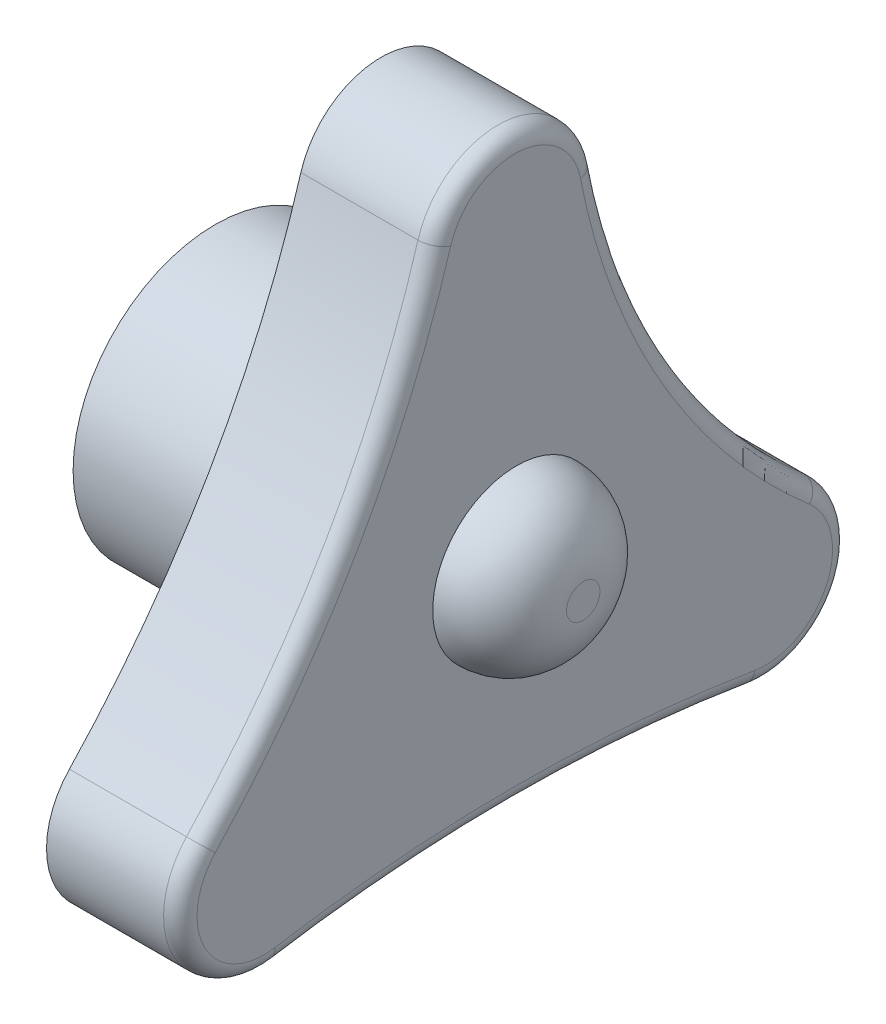
ISO-10303-21;
HEADER;
FILE_DESCRIPTION(('STEP AP214'),'2;1');
FILE_NAME('part.step','',(''),(''),'','','');
FILE_SCHEMA(('AUTOMOTIVE_DESIGN { 1 0 10303 214 1 1 1 1 }'));
ENDSEC;
DATA;
#1=APPLICATION_CONTEXT('core data for automotive mechanical design processes');
#2=APPLICATION_PROTOCOL_DEFINITION('international standard','automotive_design',2000,#1);
#3=PRODUCT_CONTEXT('',#1,'mechanical');
#4=PRODUCT('Part','Part','',(#3));
#5=PRODUCT_RELATED_PRODUCT_CATEGORY('part','',(#4));
#6=PRODUCT_DEFINITION_FORMATION('','',#4);
#7=PRODUCT_DEFINITION_CONTEXT('part definition',#1,'design');
#8=PRODUCT_DEFINITION('design','',#6,#7);
#9=PRODUCT_DEFINITION_SHAPE('','',#8);
#10=(LENGTH_UNIT() NAMED_UNIT(*) SI_UNIT(.MILLI.,.METRE.));
#11=(NAMED_UNIT(*) PLANE_ANGLE_UNIT() SI_UNIT($,.RADIAN.));
#12=(NAMED_UNIT(*) SI_UNIT($,.STERADIAN.) SOLID_ANGLE_UNIT());
#13=UNCERTAINTY_MEASURE_WITH_UNIT(LENGTH_MEASURE(1.E-05),#10,'distance_accuracy_value','');
#14=(GEOMETRIC_REPRESENTATION_CONTEXT(3) GLOBAL_UNCERTAINTY_ASSIGNED_CONTEXT((#13)) GLOBAL_UNIT_ASSIGNED_CONTEXT((#10,
#11,#12)) REPRESENTATION_CONTEXT('',''));
#15=CARTESIAN_POINT('',(0.,0.,0.));
#16=DIRECTION('',(0.,0.,1.));
#17=DIRECTION('',(1.,0.,0.));
#18=AXIS2_PLACEMENT_3D('',#15,#16,#17);
#19=CARTESIAN_POINT('',(4.,22.2408184057305,31.0222274806383));
#20=DIRECTION('',(-1.,0.,0.));
#21=DIRECTION('',(0.,0.,1.));
#22=AXIS2_PLACEMENT_3D('',#19,#20,#21);
#23=CYLINDRICAL_SURFACE('',#22,29.872043324566);
#24=DIRECTION('',(-1.,0.,0.));
#25=VECTOR('',#24,1.);
#26=CARTESIAN_POINT('',(4.,1.71759457556799,9.31655412085064));
#27=LINE('',#26,#25);
#28=CARTESIAN_POINT('',(3.5,1.71759457556799,9.31655412085064));
#29=VERTEX_POINT('',#28);
#30=CARTESIAN_POINT('',(0.,1.71759457556799,9.31655412085064));
#31=VERTEX_POINT('',#30);
#32=EDGE_CURVE('E231',#29,#31,#27,.T.);
#33=ORIENTED_EDGE('',*,*,#32,.F.);
#34=CARTESIAN_POINT('',(3.5,22.2408184057305,31.0222274806383));
#35=DIRECTION('',(1.,0.,0.));
#36=DIRECTION('',(0.,0.,-1.));
#37=AXIS2_PLACEMENT_3D('',#34,#35,#36);
#38=CIRCLE('',#37,29.872043324566);
#39=CARTESIAN_POINT('',(3.5,13.7047657849885,2.39575759626954));
#40=VERTEX_POINT('',#39);
#41=EDGE_CURVE('E256',#29,#40,#38,.T.);
#42=ORIENTED_EDGE('',*,*,#41,.T.);
#43=DIRECTION('',(-1.,0.,0.));
#44=VECTOR('',#43,1.);
#45=CARTESIAN_POINT('',(4.,13.7047657849885,2.39575759626954));
#46=LINE('',#45,#44);
#47=CARTESIAN_POINT('',(0.,13.7047657849885,2.39575759626954));
#48=VERTEX_POINT('',#47);
#49=EDGE_CURVE('E221',#40,#48,#46,.T.);
#50=ORIENTED_EDGE('',*,*,#49,.T.);
#51=CARTESIAN_POINT('',(0.,22.2408184057305,31.0222274806383));
#52=DIRECTION('',(-1.,0.,0.));
#53=DIRECTION('',(0.,0.,-1.));
#54=AXIS2_PLACEMENT_3D('',#51,#52,#53);
#55=CIRCLE('',#54,29.872043324566);
#56=EDGE_CURVE('E202',#48,#31,#55,.T.);
#57=ORIENTED_EDGE('',*,*,#56,.T.);
#58=EDGE_LOOP('',(#33,#42,#50,#57));
#59=FACE_BOUND('',#58,.T.);
#60=ADVANCED_FACE('F34',(#59),#23,.F.);
#61=CARTESIAN_POINT('',(4.,0.,7.5));
#62=DIRECTION('',(-1.,0.,0.));
#63=DIRECTION('',(0.,0.,1.));
#64=AXIS2_PLACEMENT_3D('',#61,#62,#63);
#65=CYLINDRICAL_SURFACE('',#64,2.5);
#66=DIRECTION('',(-1.,0.,0.));
#67=VECTOR('',#66,1.);
#68=CARTESIAN_POINT('',(4.,-2.46685917047385,7.09428355585568));
#69=LINE('',#68,#67);
#70=CARTESIAN_POINT('',(3.5,-2.46685917047385,7.09428355585568));
#71=VERTEX_POINT('',#70);
#72=CARTESIAN_POINT('',(0.,-2.46685917047385,7.09428355585568));
#73=VERTEX_POINT('',#72);
#74=EDGE_CURVE('E229',#71,#73,#69,.T.);
#75=ORIENTED_EDGE('',*,*,#74,.F.);
#76=CARTESIAN_POINT('',(3.5,0.,7.5));
#77=DIRECTION('',(1.,0.,0.));
#78=DIRECTION('',(0.,0.,-1.));
#79=AXIS2_PLACEMENT_3D('',#76,#77,#78);
#80=CIRCLE('',#79,2.5);
#81=EDGE_CURVE('E57',#71,#29,#80,.F.);
#82=ORIENTED_EDGE('',*,*,#81,.T.);
#83=ORIENTED_EDGE('',*,*,#32,.T.);
#84=CARTESIAN_POINT('',(0.,0.,7.5));
#85=DIRECTION('',(1.,0.,0.));
#86=DIRECTION('',(0.,0.,-1.));
#87=AXIS2_PLACEMENT_3D('',#84,#85,#86);
#88=CIRCLE('',#87,2.5);
#89=EDGE_CURVE('E205',#31,#73,#88,.T.);
#90=ORIENTED_EDGE('',*,*,#89,.T.);
#91=EDGE_LOOP('',(#75,#82,#83,#90));
#92=FACE_BOUND('',#91,.T.);
#93=ADVANCED_FACE('F296',(#92),#65,.T.);
#94=CARTESIAN_POINT('',(4.,-45.6019075528835,0.));
#95=DIRECTION('',(-1.,0.,0.));
#96=DIRECTION('',(0.,0.,1.));
#97=AXIS2_PLACEMENT_3D('',#94,#95,#96);
#98=CYLINDRICAL_SURFACE('',#97,43.7145428676054);
#99=DIRECTION('',(-1.,0.,0.));
#100=VECTOR('',#99,1.);
#101=CARTESIAN_POINT('',(4.,-2.46685917047384,-7.09428355585568));
#102=LINE('',#101,#100);
#103=CARTESIAN_POINT('',(3.5,-2.46685917047384,-7.09428355585568));
#104=VERTEX_POINT('',#103);
#105=CARTESIAN_POINT('',(0.,-2.46685917047384,-7.09428355585568));
#106=VERTEX_POINT('',#105);
#107=EDGE_CURVE('E227',#104,#106,#102,.T.);
#108=ORIENTED_EDGE('',*,*,#107,.F.);
#109=CARTESIAN_POINT('',(3.5,-45.6019075528835,0.));
#110=DIRECTION('',(1.,0.,0.));
#111=DIRECTION('',(0.,0.,-1.));
#112=AXIS2_PLACEMENT_3D('',#109,#110,#111);
#113=CIRCLE('',#112,43.7145428676054);
#114=EDGE_CURVE('E253',#104,#71,#113,.T.);
#115=ORIENTED_EDGE('',*,*,#114,.T.);
#116=ORIENTED_EDGE('',*,*,#74,.T.);
#117=CARTESIAN_POINT('',(0.,-45.6019075528835,0.));
#118=DIRECTION('',(-1.,0.,0.));
#119=DIRECTION('',(0.,0.,-1.));
#120=AXIS2_PLACEMENT_3D('',#117,#118,#119);
#121=CIRCLE('',#120,43.7145428676054);
#122=EDGE_CURVE('E209',#73,#106,#121,.T.);
#123=ORIENTED_EDGE('',*,*,#122,.T.);
#124=EDGE_LOOP('',(#108,#115,#116,#123));
#125=FACE_BOUND('',#124,.T.);
#126=ADVANCED_FACE('F302',(#125),#98,.F.);
#127=CARTESIAN_POINT('',(4.,0.,-7.5));
#128=DIRECTION('',(-1.,0.,0.));
#129=DIRECTION('',(0.,0.,1.));
#130=AXIS2_PLACEMENT_3D('',#127,#128,#129);
#131=CYLINDRICAL_SURFACE('',#130,2.5);
#132=DIRECTION('',(-1.,0.,0.));
#133=VECTOR('',#132,1.);
#134=CARTESIAN_POINT('',(4.,1.88975818990201,-9.13670827690773));
#135=LINE('',#134,#133);
#136=CARTESIAN_POINT('',(3.5,1.88975818990201,-9.13670827690773));
#137=VERTEX_POINT('',#136);
#138=CARTESIAN_POINT('',(0.,1.88975818990201,-9.13670827690773));
#139=VERTEX_POINT('',#138);
#140=EDGE_CURVE('E225',#137,#139,#135,.T.);
#141=ORIENTED_EDGE('',*,*,#140,.F.);
#142=CARTESIAN_POINT('',(3.5,0.,-7.5));
#143=DIRECTION('',(1.,0.,0.));
#144=DIRECTION('',(0.,0.,-1.));
#145=AXIS2_PLACEMENT_3D('',#142,#143,#144);
#146=CIRCLE('',#145,2.5);
#147=EDGE_CURVE('E251',#137,#104,#146,.F.);
#148=ORIENTED_EDGE('',*,*,#147,.T.);
#149=ORIENTED_EDGE('',*,*,#107,.T.);
#150=CARTESIAN_POINT('',(0.,0.,-7.5));
#151=DIRECTION('',(1.,0.,0.));
#152=DIRECTION('',(0.,0.,-1.));
#153=AXIS2_PLACEMENT_3D('',#150,#151,#152);
#154=CIRCLE('',#153,2.5);
#155=EDGE_CURVE('E212',#106,#139,#154,.T.);
#156=ORIENTED_EDGE('',*,*,#155,.T.);
#157=EDGE_LOOP('',(#141,#148,#149,#156));
#158=FACE_BOUND('',#157,.T.);
#159=ADVANCED_FACE('F361',(#158),#131,.T.);
#160=CARTESIAN_POINT('',(4.,17.3218806081074,-22.5023772958841));
#161=DIRECTION('',(-1.,0.,0.));
#162=DIRECTION('',(0.,0.,1.));
#163=AXIS2_PLACEMENT_3D('',#160,#161,#162);
#164=CYLINDRICAL_SURFACE('',#163,20.4154723348568);
#165=DIRECTION('',(-1.,0.,0.));
#166=VECTOR('',#165,1.);
#167=CARTESIAN_POINT('',(4.,13.4629329082019,-2.4549327379187));
#168=LINE('',#167,#166);
#169=CARTESIAN_POINT('',(3.5,13.4629329082019,-2.4549327379187));
#170=VERTEX_POINT('',#169);
#171=CARTESIAN_POINT('',(0.,13.4629329082019,-2.4549327379187));
#172=VERTEX_POINT('',#171);
#173=EDGE_CURVE('E223',#170,#172,#168,.T.);
#174=ORIENTED_EDGE('',*,*,#173,.F.);
#175=CARTESIAN_POINT('',(3.5,17.3218806081074,-22.5023772958841));
#176=DIRECTION('',(1.,0.,0.));
#177=DIRECTION('',(0.,0.,-1.));
#178=AXIS2_PLACEMENT_3D('',#175,#176,#177);
#179=CIRCLE('',#178,20.4154723348568);
#180=EDGE_CURVE('E249',#170,#137,#179,.T.);
#181=ORIENTED_EDGE('',*,*,#180,.T.);
#182=ORIENTED_EDGE('',*,*,#140,.T.);
#183=CARTESIAN_POINT('',(0.,17.3218806081074,-22.5023772958841));
#184=DIRECTION('',(-1.,0.,0.));
#185=DIRECTION('',(0.,0.,1.));
#186=AXIS2_PLACEMENT_3D('',#183,#184,#185);
#187=CIRCLE('',#186,20.4154723348568);
#188=EDGE_CURVE('E215',#139,#172,#187,.T.);
#189=ORIENTED_EDGE('',*,*,#188,.T.);
#190=EDGE_LOOP('',(#174,#181,#182,#189));
#191=FACE_BOUND('',#190,.T.);
#192=ADVANCED_FACE('F358',(#191),#164,.F.);
#193=CARTESIAN_POINT('',(4.,12.9903810567666,0.));
#194=DIRECTION('',(-1.,0.,0.));
#195=DIRECTION('',(0.,0.,1.));
#196=AXIS2_PLACEMENT_3D('',#193,#194,#195);
#197=CYLINDRICAL_SURFACE('',#196,2.5);
#198=ORIENTED_EDGE('',*,*,#49,.F.);
#199=CARTESIAN_POINT('',(3.5,12.9903810567666,0.));
#200=DIRECTION('',(1.,0.,0.));
#201=DIRECTION('',(0.,0.,-1.));
#202=AXIS2_PLACEMENT_3D('',#199,#200,#201);
#203=CIRCLE('',#202,2.5);
#204=EDGE_CURVE('E246',#40,#170,#203,.F.);
#205=ORIENTED_EDGE('',*,*,#204,.T.);
#206=ORIENTED_EDGE('',*,*,#173,.T.);
#207=CARTESIAN_POINT('',(0.,12.9903810567666,0.));
#208=DIRECTION('',(1.,0.,0.));
#209=DIRECTION('',(0.,0.,-1.));
#210=AXIS2_PLACEMENT_3D('',#207,#208,#209);
#211=CIRCLE('',#210,2.5);
#212=EDGE_CURVE('E218',#172,#48,#211,.T.);
#213=ORIENTED_EDGE('',*,*,#212,.T.);
#214=EDGE_LOOP('',(#198,#205,#206,#213));
#215=FACE_BOUND('',#214,.T.);
#216=ADVANCED_FACE('F347',(#215),#197,.T.);
#217=CARTESIAN_POINT('',(4.,17.6155997312485,15.5111137403191));
#218=DIRECTION('',(1.,0.,0.));
#219=DIRECTION('',(0.,0.,-1.));
#220=AXIS2_PLACEMENT_3D('',#217,#218,#219);
#221=PLANE('',#220);
#222=CARTESIAN_POINT('',(4.,4.3897697463759,-0.0449736606800847));
#223=DIRECTION('',(1.,0.,0.));
#224=DIRECTION('',(0.,0.,-1.));
#225=AXIS2_PLACEMENT_3D('',#222,#223,#224);
#226=CIRCLE('',#225,2.5);
#227=CARTESIAN_POINT('',(4.,4.3897697463759,-2.54497366068009));
#228=VERTEX_POINT('',#227);
#229=EDGE_CURVE('E550',#228,#228,#226,.T.);
#230=ORIENTED_EDGE('',*,*,#229,.F.);
#231=EDGE_LOOP('',(#230));
#232=FACE_BOUND('',#231,.T.);
#233=CARTESIAN_POINT('',(4.,17.3218806081074,-22.5023772958841));
#234=DIRECTION('',(1.,0.,0.));
#235=DIRECTION('',(0.,0.,-1.));
#236=AXIS2_PLACEMENT_3D('',#233,#234,#235);
#237=CIRCLE('',#236,20.9154723348568);
#238=CARTESIAN_POINT('',(4.,1.51180655192161,-8.80936662152619));
#239=VERTEX_POINT('',#238);
#240=CARTESIAN_POINT('',(4.,13.3684225379149,-1.96394619033496));
#241=VERTEX_POINT('',#240);
#242=EDGE_CURVE('E241',#239,#241,#237,.F.);
#243=ORIENTED_EDGE('',*,*,#242,.T.);
#244=CARTESIAN_POINT('',(4.,12.9903810567666,0.));
#245=DIRECTION('',(1.,0.,0.));
#246=DIRECTION('',(0.,0.,-1.));
#247=AXIS2_PLACEMENT_3D('',#244,#245,#246);
#248=CIRCLE('',#247,2.);
#249=CARTESIAN_POINT('',(4.,13.5618888393442,1.91660607701564));
#250=VERTEX_POINT('',#249);
#251=EDGE_CURVE('E243',#241,#250,#248,.T.);
#252=ORIENTED_EDGE('',*,*,#251,.T.);
#253=CARTESIAN_POINT('',(4.,22.2408184057305,31.0222274806383));
#254=DIRECTION('',(1.,0.,0.));
#255=DIRECTION('',(0.,0.,-1.));
#256=AXIS2_PLACEMENT_3D('',#253,#254,#255);
#257=CIRCLE('',#256,30.372043324566);
#258=CARTESIAN_POINT('',(4.,1.37407566045439,8.95324329668051));
#259=VERTEX_POINT('',#258);
#260=EDGE_CURVE('E233',#250,#259,#257,.F.);
#261=ORIENTED_EDGE('',*,*,#260,.T.);
#262=CARTESIAN_POINT('',(4.,0.,7.5));
#263=DIRECTION('',(1.,0.,0.));
#264=DIRECTION('',(0.,0.,-1.));
#265=AXIS2_PLACEMENT_3D('',#262,#263,#264);
#266=CIRCLE('',#265,2.);
#267=CARTESIAN_POINT('',(4.,-1.97348733637908,7.17542684468454));
#268=VERTEX_POINT('',#267);
#269=EDGE_CURVE('E235',#259,#268,#266,.T.);
#270=ORIENTED_EDGE('',*,*,#269,.T.);
#271=CARTESIAN_POINT('',(4.,-45.6019075528835,0.));
#272=DIRECTION('',(1.,0.,0.));
#273=DIRECTION('',(0.,0.,-1.));
#274=AXIS2_PLACEMENT_3D('',#271,#272,#273);
#275=CIRCLE('',#274,44.2145428676054);
#276=CARTESIAN_POINT('',(4.,-1.97348733637907,-7.17542684468455));
#277=VERTEX_POINT('',#276);
#278=EDGE_CURVE('E237',#268,#277,#275,.F.);
#279=ORIENTED_EDGE('',*,*,#278,.T.);
#280=CARTESIAN_POINT('',(4.,0.,-7.5));
#281=DIRECTION('',(1.,0.,0.));
#282=DIRECTION('',(0.,0.,-1.));
#283=AXIS2_PLACEMENT_3D('',#280,#281,#282);
#284=CIRCLE('',#283,2.);
#285=EDGE_CURVE('E239',#277,#239,#284,.T.);
#286=ORIENTED_EDGE('',*,*,#285,.T.);
#287=EDGE_LOOP('',(#243,#252,#261,#270,#279,#286));
#288=FACE_BOUND('',#287,.T.);
#289=ADVANCED_FACE('F332',(#232,#288),#221,.T.);
#290=CARTESIAN_POINT('',(0.,17.6155997312485,15.5111137403191));
#291=DIRECTION('',(1.,0.,0.));
#292=DIRECTION('',(0.,0.,-1.));
#293=AXIS2_PLACEMENT_3D('',#290,#291,#292);
#294=PLANE('',#293);
#295=CARTESIAN_POINT('',(0.,12.9903810567666,0.));
#296=DIRECTION('',(1.,0.,0.));
#297=DIRECTION('',(0.,0.,-1.));
#298=AXIS2_PLACEMENT_3D('',#295,#296,#297);
#299=CIRCLE('',#298,1.5);
#300=CARTESIAN_POINT('',(0.,13.2739121676278,-1.47295964275122));
#301=VERTEX_POINT('',#300);
#302=CARTESIAN_POINT('',(0.,13.4190118936998,1.43745455776172));
#303=VERTEX_POINT('',#302);
#304=EDGE_CURVE('E177',#301,#303,#299,.T.);
#305=ORIENTED_EDGE('',*,*,#304,.T.);
#306=CARTESIAN_POINT('',(0.,22.2408184057305,31.0222274806383));
#307=DIRECTION('',(1.,0.,0.));
#308=DIRECTION('',(0.,0.,-1.));
#309=AXIS2_PLACEMENT_3D('',#306,#307,#308);
#310=CIRCLE('',#309,30.872043324566);
#311=CARTESIAN_POINT('',(0.,1.03055674534079,8.58993247251039));
#312=VERTEX_POINT('',#311);
#313=EDGE_CURVE('E190',#303,#312,#310,.F.);
#314=ORIENTED_EDGE('',*,*,#313,.T.);
#315=CARTESIAN_POINT('',(0.,0.,7.5));
#316=DIRECTION('',(1.,0.,0.));
#317=DIRECTION('',(0.,0.,-1.));
#318=AXIS2_PLACEMENT_3D('',#315,#316,#317);
#319=CIRCLE('',#318,1.5);
#320=CARTESIAN_POINT('',(0.,-1.48011550228431,7.25657013351341));
#321=VERTEX_POINT('',#320);
#322=EDGE_CURVE('E166',#312,#321,#319,.T.);
#323=ORIENTED_EDGE('',*,*,#322,.T.);
#324=CARTESIAN_POINT('',(0.,-45.6019075528835,0.));
#325=DIRECTION('',(1.,0.,0.));
#326=DIRECTION('',(0.,0.,-1.));
#327=AXIS2_PLACEMENT_3D('',#324,#325,#326);
#328=CIRCLE('',#327,44.7145428676054);
#329=CARTESIAN_POINT('',(0.,-1.4801155022843,-7.25657013351341));
#330=VERTEX_POINT('',#329);
#331=EDGE_CURVE('E49',#321,#330,#328,.F.);
#332=ORIENTED_EDGE('',*,*,#331,.T.);
#333=CARTESIAN_POINT('',(0.,0.,-7.5));
#334=DIRECTION('',(1.,0.,0.));
#335=DIRECTION('',(0.,0.,-1.));
#336=AXIS2_PLACEMENT_3D('',#333,#334,#335);
#337=CIRCLE('',#336,1.5);
#338=CARTESIAN_POINT('',(0.,1.13385491394121,-8.48202496614464));
#339=VERTEX_POINT('',#338);
#340=EDGE_CURVE('E197',#330,#339,#337,.T.);
#341=ORIENTED_EDGE('',*,*,#340,.T.);
#342=CARTESIAN_POINT('',(0.,17.3218806081074,-22.5023772958841));
#343=DIRECTION('',(1.,0.,0.));
#344=DIRECTION('',(0.,0.,-1.));
#345=AXIS2_PLACEMENT_3D('',#342,#343,#344);
#346=CIRCLE('',#345,21.4154723348568);
#347=EDGE_CURVE('E194',#339,#301,#346,.F.);
#348=ORIENTED_EDGE('',*,*,#347,.T.);
#349=EDGE_LOOP('',(#305,#314,#323,#332,#341,#348));
#350=FACE_BOUND('',#349,.T.);
#351=ORIENTED_EDGE('',*,*,#56,.F.);
#352=ORIENTED_EDGE('',*,*,#212,.F.);
#353=ORIENTED_EDGE('',*,*,#188,.F.);
#354=ORIENTED_EDGE('',*,*,#155,.F.);
#355=ORIENTED_EDGE('',*,*,#122,.F.);
#356=ORIENTED_EDGE('',*,*,#89,.F.);
#357=EDGE_LOOP('',(#351,#352,#353,#354,#355,#356));
#358=FACE_BOUND('',#357,.T.);
#359=ADVANCED_FACE('F327',(#350,#358),#294,.F.);
#360=CARTESIAN_POINT('',(3.5,-45.6019075528835,0.));
#361=DIRECTION('',(1.,0.,0.));
#362=DIRECTION('',(0.,0.,-1.));
#363=AXIS2_PLACEMENT_3D('',#360,#361,#362);
#364=TOROIDAL_SURFACE('',#363,44.2145428676054,0.5);
#365=CARTESIAN_POINT('',(3.5,-1.97348733637908,7.17542684468454));
#366=DIRECTION('',(0.,-0.162286577657727,0.986743668189537));
#367=DIRECTION('',(0.,-0.986743668189537,-0.162286577657727));
#368=AXIS2_PLACEMENT_3D('',#365,#366,#367);
#369=CIRCLE('',#368,0.5);
#370=EDGE_CURVE('E267',#71,#268,#369,.T.);
#371=ORIENTED_EDGE('',*,*,#370,.F.);
#372=ORIENTED_EDGE('',*,*,#114,.F.);
#373=CARTESIAN_POINT('',(3.5,-1.97348733637907,-7.17542684468455));
#374=DIRECTION('',(0.,-0.162286577657727,-0.986743668189537));
#375=DIRECTION('',(0.,0.986743668189537,-0.162286577657727));
#376=AXIS2_PLACEMENT_3D('',#373,#374,#375);
#377=CIRCLE('',#376,0.5);
#378=EDGE_CURVE('E206',#277,#104,#377,.T.);
#379=ORIENTED_EDGE('',*,*,#378,.F.);
#380=ORIENTED_EDGE('',*,*,#278,.F.);
#381=EDGE_LOOP('',(#371,#372,#379,#380));
#382=FACE_BOUND('',#381,.T.);
#383=ADVANCED_FACE('F324',(#382),#364,.T.);
#384=CARTESIAN_POINT('',(3.5,0.,-7.5));
#385=DIRECTION('',(1.,0.,0.));
#386=DIRECTION('',(0.,0.,-1.));
#387=AXIS2_PLACEMENT_3D('',#384,#385,#386);
#388=TOROIDAL_SURFACE('',#387,2.,0.5);
#389=ORIENTED_EDGE('',*,*,#378,.T.);
#390=ORIENTED_EDGE('',*,*,#147,.F.);
#391=CARTESIAN_POINT('',(3.5,1.51180655192161,-8.80936662152619));
#392=DIRECTION('',(0.,0.654683310763092,0.755903275960805));
#393=DIRECTION('',(0.,-0.755903275960805,0.654683310763092));
#394=AXIS2_PLACEMENT_3D('',#391,#392,#393);
#395=CIRCLE('',#394,0.5);
#396=EDGE_CURVE('E264',#239,#137,#395,.T.);
#397=ORIENTED_EDGE('',*,*,#396,.F.);
#398=ORIENTED_EDGE('',*,*,#285,.F.);
#399=EDGE_LOOP('',(#389,#390,#397,#398));
#400=FACE_BOUND('',#399,.T.);
#401=ADVANCED_FACE('F321',(#400),#388,.T.);
#402=CARTESIAN_POINT('',(3.5,0.,7.5));
#403=DIRECTION('',(1.,0.,0.));
#404=DIRECTION('',(0.,0.,-1.));
#405=AXIS2_PLACEMENT_3D('',#402,#403,#404);
#406=TOROIDAL_SURFACE('',#405,2.,0.5);
#407=ORIENTED_EDGE('',*,*,#370,.T.);
#408=ORIENTED_EDGE('',*,*,#269,.F.);
#409=CARTESIAN_POINT('',(3.5,1.37407566045439,8.95324329668051));
#410=DIRECTION('',(0.,0.726621648340256,-0.687037830227193));
#411=DIRECTION('',(0.,0.687037830227193,0.726621648340256));
#412=AXIS2_PLACEMENT_3D('',#409,#410,#411);
#413=CIRCLE('',#412,0.5);
#414=EDGE_CURVE('E261',#29,#259,#413,.T.);
#415=ORIENTED_EDGE('',*,*,#414,.F.);
#416=ORIENTED_EDGE('',*,*,#81,.F.);
#417=EDGE_LOOP('',(#407,#408,#415,#416));
#418=FACE_BOUND('',#417,.T.);
#419=ADVANCED_FACE('F317',(#418),#406,.T.);
#420=CARTESIAN_POINT('',(3.5,17.3218806081074,-22.5023772958841));
#421=DIRECTION('',(1.,0.,0.));
#422=DIRECTION('',(0.,0.,-1.));
#423=AXIS2_PLACEMENT_3D('',#420,#421,#422);
#424=TOROIDAL_SURFACE('',#423,20.9154723348568,0.5);
#425=ORIENTED_EDGE('',*,*,#396,.T.);
#426=ORIENTED_EDGE('',*,*,#180,.F.);
#427=CARTESIAN_POINT('',(3.5,13.3684225379149,-1.96394619033496));
#428=DIRECTION('',(0.,0.981973095167482,0.189020740574139));
#429=DIRECTION('',(0.,-0.189020740574139,0.981973095167482));
#430=AXIS2_PLACEMENT_3D('',#427,#428,#429);
#431=CIRCLE('',#430,0.5);
#432=EDGE_CURVE('E259',#241,#170,#431,.T.);
#433=ORIENTED_EDGE('',*,*,#432,.F.);
#434=ORIENTED_EDGE('',*,*,#242,.F.);
#435=EDGE_LOOP('',(#425,#426,#433,#434));
#436=FACE_BOUND('',#435,.T.);
#437=ADVANCED_FACE('F313',(#436),#424,.T.);
#438=CARTESIAN_POINT('',(3.5,22.2408184057305,31.0222274806383));
#439=DIRECTION('',(1.,0.,0.));
#440=DIRECTION('',(0.,0.,-1.));
#441=AXIS2_PLACEMENT_3D('',#438,#439,#440);
#442=TOROIDAL_SURFACE('',#441,30.372043324566,0.5);
#443=ORIENTED_EDGE('',*,*,#414,.T.);
#444=ORIENTED_EDGE('',*,*,#260,.F.);
#445=CARTESIAN_POINT('',(3.5,13.5618888393442,1.91660607701563));
#446=DIRECTION('',(0.,0.958303038507818,-0.285753891288786));
#447=DIRECTION('',(0.,0.285753891288786,0.958303038507818));
#448=AXIS2_PLACEMENT_3D('',#445,#446,#447);
#449=CIRCLE('',#448,0.5);
#450=EDGE_CURVE('E182',#40,#250,#449,.T.);
#451=ORIENTED_EDGE('',*,*,#450,.F.);
#452=ORIENTED_EDGE('',*,*,#41,.F.);
#453=EDGE_LOOP('',(#443,#444,#451,#452));
#454=FACE_BOUND('',#453,.T.);
#455=ADVANCED_FACE('F309',(#454),#442,.T.);
#456=CARTESIAN_POINT('',(3.5,12.9903810567666,0.));
#457=DIRECTION('',(1.,0.,0.));
#458=DIRECTION('',(0.,0.,-1.));
#459=AXIS2_PLACEMENT_3D('',#456,#457,#458);
#460=TOROIDAL_SURFACE('',#459,2.,0.5);
#461=ORIENTED_EDGE('',*,*,#432,.T.);
#462=ORIENTED_EDGE('',*,*,#204,.F.);
#463=ORIENTED_EDGE('',*,*,#450,.T.);
#464=ORIENTED_EDGE('',*,*,#251,.F.);
#465=EDGE_LOOP('',(#461,#462,#463,#464));
#466=FACE_BOUND('',#465,.T.);
#467=ADVANCED_FACE('F306',(#466),#460,.T.);
#468=CARTESIAN_POINT('',(4.,22.2408184057305,31.0222274806383));
#469=DIRECTION('',(-1.,0.,0.));
#470=DIRECTION('',(0.,0.,1.));
#471=AXIS2_PLACEMENT_3D('',#468,#469,#470);
#472=CYLINDRICAL_SURFACE('',#471,30.872043324566);
#473=DIRECTION('',(-1.,0.,0.));
#474=VECTOR('',#473,1.);
#475=CARTESIAN_POINT('',(4.,1.03055674534079,8.58993247251039));
#476=LINE('',#475,#474);
#477=CARTESIAN_POINT('',(3.,1.03055674534079,8.58993247251039));
#478=VERTEX_POINT('',#477);
#479=EDGE_CURVE('E148',#478,#312,#476,.T.);
#480=ORIENTED_EDGE('',*,*,#479,.T.);
#481=ORIENTED_EDGE('',*,*,#313,.F.);
#482=DIRECTION('',(-1.,0.,0.));
#483=VECTOR('',#482,1.);
#484=CARTESIAN_POINT('',(4.,13.4190118936998,1.43745455776172));
#485=LINE('',#484,#483);
#486=CARTESIAN_POINT('',(3.,13.4190118936998,1.43745455776172));
#487=VERTEX_POINT('',#486);
#488=EDGE_CURVE('E150',#487,#303,#485,.T.);
#489=ORIENTED_EDGE('',*,*,#488,.F.);
#490=CARTESIAN_POINT('',(3.,22.2408184057305,31.0222274806383));
#491=DIRECTION('',(1.,0.,0.));
#492=DIRECTION('',(0.,0.,-1.));
#493=AXIS2_PLACEMENT_3D('',#490,#491,#492);
#494=CIRCLE('',#493,30.872043324566);
#495=EDGE_CURVE('E143',#487,#478,#494,.F.);
#496=ORIENTED_EDGE('',*,*,#495,.T.);
#497=EDGE_LOOP('',(#480,#481,#489,#496));
#498=FACE_BOUND('',#497,.T.);
#499=ADVANCED_FACE('F145',(#498),#472,.T.);
#500=CARTESIAN_POINT('',(4.,0.,7.5));
#501=DIRECTION('',(-1.,0.,0.));
#502=DIRECTION('',(0.,0.,1.));
#503=AXIS2_PLACEMENT_3D('',#500,#501,#502);
#504=CYLINDRICAL_SURFACE('',#503,1.5);
#505=DIRECTION('',(-1.,0.,0.));
#506=VECTOR('',#505,1.);
#507=CARTESIAN_POINT('',(4.,-1.48011550228431,7.25657013351341));
#508=LINE('',#507,#506);
#509=CARTESIAN_POINT('',(3.,-1.48011550228431,7.25657013351341));
#510=VERTEX_POINT('',#509);
#511=EDGE_CURVE('E168',#510,#321,#508,.T.);
#512=ORIENTED_EDGE('',*,*,#511,.T.);
#513=ORIENTED_EDGE('',*,*,#322,.F.);
#514=ORIENTED_EDGE('',*,*,#479,.F.);
#515=CARTESIAN_POINT('',(3.,0.,7.5));
#516=DIRECTION('',(1.,0.,0.));
#517=DIRECTION('',(0.,0.,-1.));
#518=AXIS2_PLACEMENT_3D('',#515,#516,#517);
#519=CIRCLE('',#518,1.5);
#520=EDGE_CURVE('E153',#478,#510,#519,.T.);
#521=ORIENTED_EDGE('',*,*,#520,.T.);
#522=EDGE_LOOP('',(#512,#513,#514,#521));
#523=FACE_BOUND('',#522,.T.);
#524=ADVANCED_FACE('F164',(#523),#504,.F.);
#525=CARTESIAN_POINT('',(4.,-45.6019075528835,0.));
#526=DIRECTION('',(-1.,0.,0.));
#527=DIRECTION('',(0.,0.,1.));
#528=AXIS2_PLACEMENT_3D('',#525,#526,#527);
#529=CYLINDRICAL_SURFACE('',#528,44.7145428676054);
#530=DIRECTION('',(-1.,0.,0.));
#531=VECTOR('',#530,1.);
#532=CARTESIAN_POINT('',(4.,-1.4801155022843,-7.25657013351341));
#533=LINE('',#532,#531);
#534=CARTESIAN_POINT('',(3.,-1.4801155022843,-7.25657013351341));
#535=VERTEX_POINT('',#534);
#536=EDGE_CURVE('E170',#535,#330,#533,.T.);
#537=ORIENTED_EDGE('',*,*,#536,.T.);
#538=ORIENTED_EDGE('',*,*,#331,.F.);
#539=ORIENTED_EDGE('',*,*,#511,.F.);
#540=CARTESIAN_POINT('',(3.,-45.6019075528835,0.));
#541=DIRECTION('',(1.,0.,0.));
#542=DIRECTION('',(0.,0.,-1.));
#543=AXIS2_PLACEMENT_3D('',#540,#541,#542);
#544=CIRCLE('',#543,44.7145428676054);
#545=EDGE_CURVE('E160',#535,#510,#544,.T.);
#546=ORIENTED_EDGE('',*,*,#545,.F.);
#547=EDGE_LOOP('',(#537,#538,#539,#546));
#548=FACE_BOUND('',#547,.T.);
#549=ADVANCED_FACE('F457',(#548),#529,.T.);
#550=CARTESIAN_POINT('',(4.,0.,-7.5));
#551=DIRECTION('',(-1.,0.,0.));
#552=DIRECTION('',(0.,0.,1.));
#553=AXIS2_PLACEMENT_3D('',#550,#551,#552);
#554=CYLINDRICAL_SURFACE('',#553,1.5);
#555=DIRECTION('',(-1.,0.,0.));
#556=VECTOR('',#555,1.);
#557=CARTESIAN_POINT('',(4.,1.13385491394121,-8.48202496614464));
#558=LINE('',#557,#556);
#559=CARTESIAN_POINT('',(3.,1.13385491394121,-8.48202496614464));
#560=VERTEX_POINT('',#559);
#561=EDGE_CURVE('E180',#560,#339,#558,.T.);
#562=ORIENTED_EDGE('',*,*,#561,.T.);
#563=ORIENTED_EDGE('',*,*,#340,.F.);
#564=ORIENTED_EDGE('',*,*,#536,.F.);
#565=CARTESIAN_POINT('',(3.,0.,-7.5));
#566=DIRECTION('',(1.,0.,0.));
#567=DIRECTION('',(0.,0.,-1.));
#568=AXIS2_PLACEMENT_3D('',#565,#566,#567);
#569=CIRCLE('',#568,1.5);
#570=EDGE_CURVE('E183',#560,#535,#569,.F.);
#571=ORIENTED_EDGE('',*,*,#570,.F.);
#572=EDGE_LOOP('',(#562,#563,#564,#571));
#573=FACE_BOUND('',#572,.T.);
#574=ADVANCED_FACE('F466',(#573),#554,.F.);
#575=CARTESIAN_POINT('',(4.,17.3218806081074,-22.5023772958841));
#576=DIRECTION('',(-1.,0.,0.));
#577=DIRECTION('',(0.,0.,1.));
#578=AXIS2_PLACEMENT_3D('',#575,#576,#577);
#579=CYLINDRICAL_SURFACE('',#578,21.4154723348568);
#580=DIRECTION('',(-1.,0.,0.));
#581=VECTOR('',#580,1.);
#582=CARTESIAN_POINT('',(4.,13.2739121676278,-1.47295964275122));
#583=LINE('',#582,#581);
#584=CARTESIAN_POINT('',(3.,13.2739121676278,-1.47295964275122));
#585=VERTEX_POINT('',#584);
#586=EDGE_CURVE('E176',#585,#301,#583,.T.);
#587=ORIENTED_EDGE('',*,*,#586,.T.);
#588=ORIENTED_EDGE('',*,*,#347,.F.);
#589=ORIENTED_EDGE('',*,*,#561,.F.);
#590=CARTESIAN_POINT('',(3.,17.3218806081074,-22.5023772958841));
#591=DIRECTION('',(1.,0.,0.));
#592=DIRECTION('',(0.,0.,-1.));
#593=AXIS2_PLACEMENT_3D('',#590,#591,#592);
#594=CIRCLE('',#593,21.4154723348568);
#595=EDGE_CURVE('E186',#585,#560,#594,.T.);
#596=ORIENTED_EDGE('',*,*,#595,.F.);
#597=EDGE_LOOP('',(#587,#588,#589,#596));
#598=FACE_BOUND('',#597,.T.);
#599=ADVANCED_FACE('F287',(#598),#579,.T.);
#600=CARTESIAN_POINT('',(4.,12.9903810567666,0.));
#601=DIRECTION('',(-1.,0.,0.));
#602=DIRECTION('',(0.,0.,1.));
#603=AXIS2_PLACEMENT_3D('',#600,#601,#602);
#604=CYLINDRICAL_SURFACE('',#603,1.5);
#605=ORIENTED_EDGE('',*,*,#488,.T.);
#606=ORIENTED_EDGE('',*,*,#304,.F.);
#607=ORIENTED_EDGE('',*,*,#586,.F.);
#608=CARTESIAN_POINT('',(3.,12.9903810567666,0.));
#609=DIRECTION('',(1.,0.,0.));
#610=DIRECTION('',(0.,0.,-1.));
#611=AXIS2_PLACEMENT_3D('',#608,#609,#610);
#612=CIRCLE('',#611,1.5);
#613=EDGE_CURVE('E162',#487,#585,#612,.F.);
#614=ORIENTED_EDGE('',*,*,#613,.F.);
#615=EDGE_LOOP('',(#605,#606,#607,#614));
#616=FACE_BOUND('',#615,.T.);
#617=ADVANCED_FACE('F278',(#616),#604,.F.);
#618=CARTESIAN_POINT('',(3.,17.6155997312485,15.5111137403191));
#619=DIRECTION('',(1.,0.,0.));
#620=DIRECTION('',(0.,0.,-1.));
#621=AXIS2_PLACEMENT_3D('',#618,#619,#620);
#622=PLANE('',#621);
#623=CARTESIAN_POINT('',(3.,4.38968208864176,-0.0449730326404531));
#624=DIRECTION('',(1.,0.,0.));
#625=DIRECTION('',(0.,0.,-1.));
#626=AXIS2_PLACEMENT_3D('',#623,#624,#625);
#627=CIRCLE('',#626,4.25);
#628=CARTESIAN_POINT('',(3.,4.38968208864176,-4.29497303264045));
#629=VERTEX_POINT('',#628);
#630=EDGE_CURVE('E42',#629,#629,#627,.F.);
#631=ORIENTED_EDGE('',*,*,#630,.F.);
#632=EDGE_LOOP('',(#631));
#633=FACE_BOUND('',#632,.T.);
#634=ORIENTED_EDGE('',*,*,#595,.T.);
#635=ORIENTED_EDGE('',*,*,#570,.T.);
#636=ORIENTED_EDGE('',*,*,#545,.T.);
#637=ORIENTED_EDGE('',*,*,#520,.F.);
#638=ORIENTED_EDGE('',*,*,#495,.F.);
#639=ORIENTED_EDGE('',*,*,#613,.T.);
#640=EDGE_LOOP('',(#634,#635,#636,#637,#638,#639));
#641=FACE_BOUND('',#640,.T.);
#642=ADVANCED_FACE('F157',(#633,#641),#622,.F.);
#643=CARTESIAN_POINT('',(-5.,4.38968208864176,-0.0449730326404531));
#644=DIRECTION('',(-1.,0.,0.));
#645=DIRECTION('',(0.,0.,1.));
#646=AXIS2_PLACEMENT_3D('',#643,#644,#645);
#647=PLANE('',#646);
#648=CARTESIAN_POINT('',(-5.,4.38968208864176,-0.0449730326404531));
#649=DIRECTION('',(-1.,0.,0.));
#650=DIRECTION('',(0.,0.,1.));
#651=AXIS2_PLACEMENT_3D('',#648,#649,#650);
#652=CIRCLE('',#651,4.25);
#653=CARTESIAN_POINT('',(-5.,4.38968208864176,4.20502696735955));
#654=VERTEX_POINT('',#653);
#655=EDGE_CURVE('E173',#654,#654,#652,.T.);
#656=ORIENTED_EDGE('',*,*,#655,.T.);
#657=EDGE_LOOP('',(#656));
#658=FACE_BOUND('',#657,.T.);
#659=CARTESIAN_POINT('',(-5.,4.38968208864176,-0.0449730326404531));
#660=DIRECTION('',(-1.,0.,0.));
#661=DIRECTION('',(0.,0.,1.));
#662=AXIS2_PLACEMENT_3D('',#659,#660,#661);
#663=CIRCLE('',#662,2.25);
#664=CARTESIAN_POINT('',(-5.,4.38968208864176,2.20502696735955));
#665=VERTEX_POINT('',#664);
#666=EDGE_CURVE('E555',#665,#665,#663,.T.);
#667=ORIENTED_EDGE('',*,*,#666,.F.);
#668=EDGE_LOOP('',(#667));
#669=FACE_BOUND('',#668,.T.);
#670=ADVANCED_FACE('F277',(#658,#669),#647,.T.);
#671=CARTESIAN_POINT('',(-5.,4.38968208864176,-0.0449730326404531));
#672=DIRECTION('',(1.,0.,0.));
#673=DIRECTION('',(0.,0.,-1.));
#674=AXIS2_PLACEMENT_3D('',#671,#672,#673);
#675=CYLINDRICAL_SURFACE('',#674,4.25);
#676=ORIENTED_EDGE('',*,*,#655,.F.);
#677=EDGE_LOOP('',(#676));
#678=FACE_BOUND('',#677,.T.);
#679=ORIENTED_EDGE('',*,*,#630,.T.);
#680=EDGE_LOOP('',(#679));
#681=FACE_BOUND('',#680,.T.);
#682=ADVANCED_FACE('F274',(#678,#681),#675,.T.);
#683=CARTESIAN_POINT('',(-5.,4.38968208864176,-0.0449730326404531));
#684=DIRECTION('',(1.,0.,0.));
#685=DIRECTION('',(0.,0.,-1.));
#686=AXIS2_PLACEMENT_3D('',#683,#684,#685);
#687=CYLINDRICAL_SURFACE('',#686,2.25);
#688=ORIENTED_EDGE('',*,*,#666,.T.);
#689=EDGE_LOOP('',(#688));
#690=FACE_BOUND('',#689,.T.);
#691=CARTESIAN_POINT('',(3.,4.38968208864176,-0.0449730326404531));
#692=DIRECTION('',(-1.,0.,0.));
#693=DIRECTION('',(0.,0.,1.));
#694=AXIS2_PLACEMENT_3D('',#691,#692,#693);
#695=CIRCLE('',#694,2.25);
#696=CARTESIAN_POINT('',(3.,4.38968208864176,2.20502696735955));
#697=VERTEX_POINT('',#696);
#698=EDGE_CURVE('E552',#697,#697,#695,.T.);
#699=ORIENTED_EDGE('',*,*,#698,.F.);
#700=EDGE_LOOP('',(#699));
#701=FACE_BOUND('',#700,.T.);
#702=ADVANCED_FACE('F293',(#690,#701),#687,.F.);
#703=ORIENTED_EDGE('',*,*,#698,.T.);
#704=EDGE_LOOP('',(#703));
#705=FACE_BOUND('',#704,.T.);
#706=ADVANCED_FACE('F280',(#705),#622,.F.);
#707=CARTESIAN_POINT('',(6.,4.3897697463759,-0.0449736606800847));
#708=DIRECTION('',(1.,0.,0.));
#709=DIRECTION('',(0.,0.,-1.));
#710=AXIS2_PLACEMENT_3D('',#707,#708,#709);
#711=PLANE('',#710);
#712=CARTESIAN_POINT('',(6.,4.3897697463759,-0.0449736606800847));
#713=DIRECTION('',(1.,0.,0.));
#714=DIRECTION('',(0.,0.,-1.));
#715=AXIS2_PLACEMENT_3D('',#712,#713,#714);
#716=CIRCLE('',#715,0.5);
#717=CARTESIAN_POINT('',(6.,4.3897697463759,-0.544973660680085));
#718=VERTEX_POINT('',#717);
#719=EDGE_CURVE('E11',#718,#718,#716,.T.);
#720=ORIENTED_EDGE('',*,*,#719,.T.);
#721=EDGE_LOOP('',(#720));
#722=FACE_BOUND('',#721,.T.);
#723=ADVANCED_FACE('F292',(#722),#711,.T.);
#724=CARTESIAN_POINT('',(4.,4.3897697463759,-0.0449736606800847));
#725=DIRECTION('',(1.,0.,0.));
#726=DIRECTION('',(0.,0.,-1.));
#727=AXIS2_PLACEMENT_3D('',#724,#725,#726);
#728=DEGENERATE_TOROIDAL_SURFACE('',#727,0.5,2.,.T.);
#729=ORIENTED_EDGE('',*,*,#229,.T.);
#730=EDGE_LOOP('',(#729));
#731=FACE_BOUND('',#730,.T.);
#732=ORIENTED_EDGE('',*,*,#719,.F.);
#733=EDGE_LOOP('',(#732));
#734=FACE_BOUND('',#733,.T.);
#735=ADVANCED_FACE('F36',(#731,#734),#728,.T.);
#736=CLOSED_SHELL('',(#60,#93,#126,#159,#192,#216,#289,#359,#383,#401,#419,#437,#455,#467,#499,
#524,#549,#574,#599,#617,#642,#670,#682,#702,#706,#723,#735));
#737=MANIFOLD_SOLID_BREP('B2',#736);
#738=ADVANCED_BREP_SHAPE_REPRESENTATION('',(#18,#737),#14);
#739=SHAPE_DEFINITION_REPRESENTATION(#9,#738);
ENDSEC;
END-ISO-10303-21;
